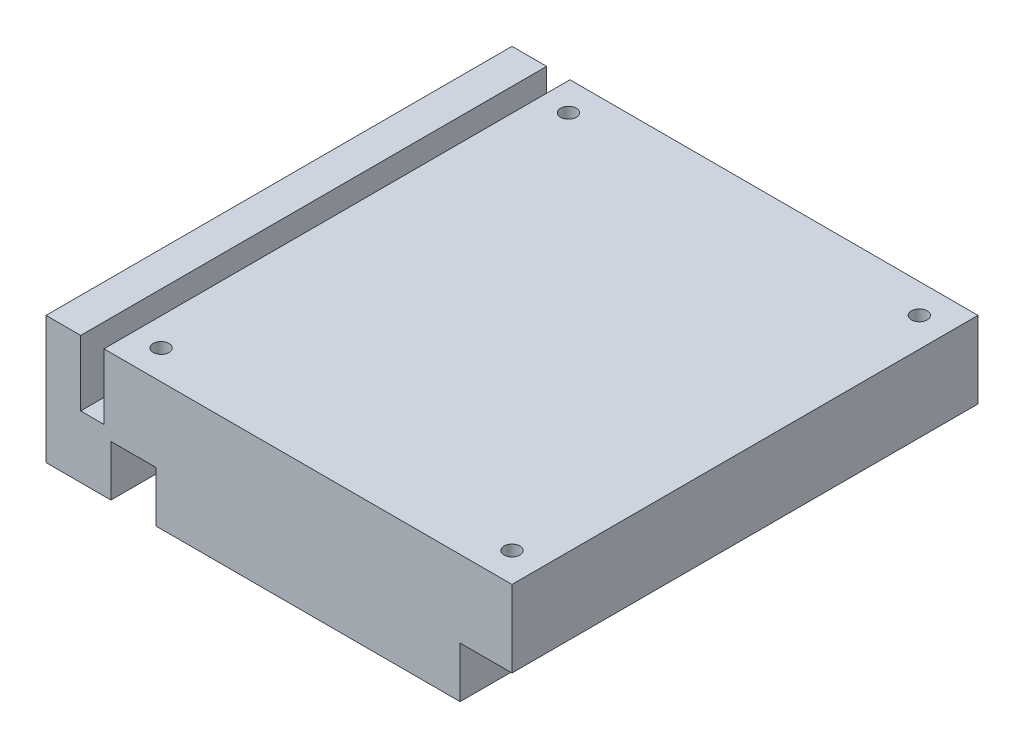
ISO-10303-21;
HEADER;
FILE_DESCRIPTION(('STEP AP214'),'2;1');
FILE_NAME('part.step','',(''),(''),'','','');
FILE_SCHEMA(('AUTOMOTIVE_DESIGN { 1 0 10303 214 1 1 1 1 }'));
ENDSEC;
DATA;
#1=APPLICATION_CONTEXT('core data for automotive mechanical design processes');
#2=APPLICATION_PROTOCOL_DEFINITION('international standard','automotive_design',2000,#1);
#3=PRODUCT_CONTEXT('',#1,'mechanical');
#4=PRODUCT('Part','Part','',(#3));
#5=PRODUCT_RELATED_PRODUCT_CATEGORY('part','',(#4));
#6=PRODUCT_DEFINITION_FORMATION('','',#4);
#7=PRODUCT_DEFINITION_CONTEXT('part definition',#1,'design');
#8=PRODUCT_DEFINITION('design','',#6,#7);
#9=PRODUCT_DEFINITION_SHAPE('','',#8);
#10=(LENGTH_UNIT() NAMED_UNIT(*) SI_UNIT(.MILLI.,.METRE.));
#11=(NAMED_UNIT(*) PLANE_ANGLE_UNIT() SI_UNIT($,.RADIAN.));
#12=(NAMED_UNIT(*) SI_UNIT($,.STERADIAN.) SOLID_ANGLE_UNIT());
#13=UNCERTAINTY_MEASURE_WITH_UNIT(LENGTH_MEASURE(1.E-05),#10,'distance_accuracy_value','');
#14=(GEOMETRIC_REPRESENTATION_CONTEXT(3) GLOBAL_UNCERTAINTY_ASSIGNED_CONTEXT((#13)) GLOBAL_UNIT_ASSIGNED_CONTEXT((#10,
#11,#12)) REPRESENTATION_CONTEXT('',''));
#15=CARTESIAN_POINT('',(0.,0.,0.));
#16=DIRECTION('',(0.,0.,1.));
#17=DIRECTION('',(1.,0.,0.));
#18=AXIS2_PLACEMENT_3D('',#15,#16,#17);
#19=CARTESIAN_POINT('',(0.,0.,0.));
#20=DIRECTION('',(0.,-1.,0.));
#21=DIRECTION('',(0.,0.,-1.));
#22=AXIS2_PLACEMENT_3D('',#19,#20,#21);
#23=PLANE('',#22);
#24=CARTESIAN_POINT('',(98.298,0.,-98.298));
#25=DIRECTION('',(0.,1.,0.));
#26=DIRECTION('',(0.,0.,1.));
#27=AXIS2_PLACEMENT_3D('',#24,#25,#26);
#28=CIRCLE('',#27,1.778);
#29=CARTESIAN_POINT('',(98.298,0.,-96.52));
#30=VERTEX_POINT('',#29);
#31=EDGE_CURVE('E254',#30,#30,#28,.T.);
#32=ORIENTED_EDGE('',*,*,#31,.T.);
#33=EDGE_LOOP('',(#32));
#34=FACE_BOUND('',#33,.T.);
#35=CARTESIAN_POINT('',(19.304,0.,-6.604));
#36=DIRECTION('',(0.,1.,0.));
#37=DIRECTION('',(0.,0.,1.));
#38=AXIS2_PLACEMENT_3D('',#35,#36,#37);
#39=CIRCLE('',#38,1.778);
#40=CARTESIAN_POINT('',(19.304,0.,-4.826));
#41=VERTEX_POINT('',#40);
#42=EDGE_CURVE('E261',#41,#41,#39,.T.);
#43=ORIENTED_EDGE('',*,*,#42,.T.);
#44=EDGE_LOOP('',(#43));
#45=FACE_BOUND('',#44,.T.);
#46=CARTESIAN_POINT('',(19.304,0.,-98.298));
#47=DIRECTION('',(0.,1.,0.));
#48=DIRECTION('',(0.,0.,1.));
#49=AXIS2_PLACEMENT_3D('',#46,#47,#48);
#50=CIRCLE('',#49,1.778);
#51=CARTESIAN_POINT('',(19.304,0.,-96.52));
#52=VERTEX_POINT('',#51);
#53=EDGE_CURVE('E248',#52,#52,#50,.T.);
#54=ORIENTED_EDGE('',*,*,#53,.T.);
#55=EDGE_LOOP('',(#54));
#56=FACE_BOUND('',#55,.T.);
#57=CARTESIAN_POINT('',(98.298,0.,-6.604));
#58=DIRECTION('',(0.,1.,0.));
#59=DIRECTION('',(0.,0.,1.));
#60=AXIS2_PLACEMENT_3D('',#57,#58,#59);
#61=CIRCLE('',#60,1.77800000000001);
#62=CARTESIAN_POINT('',(98.298,0.,-4.82599999999999));
#63=VERTEX_POINT('',#62);
#64=EDGE_CURVE('E266',#63,#63,#61,.T.);
#65=ORIENTED_EDGE('',*,*,#64,.T.);
#66=EDGE_LOOP('',(#65));
#67=FACE_BOUND('',#66,.T.);
#68=DIRECTION('',(0.,0.,1.));
#69=VECTOR('',#68,1.);
#70=CARTESIAN_POINT('',(14.6169324071934,0.,0.));
#71=LINE('',#70,#69);
#72=CARTESIAN_POINT('',(14.6169324071934,0.,-13.5988038651931));
#73=VERTEX_POINT('',#72);
#74=CARTESIAN_POINT('',(14.6169324071934,0.,0.));
#75=VERTEX_POINT('',#74);
#76=EDGE_CURVE('E182',#73,#75,#71,.T.);
#77=ORIENTED_EDGE('',*,*,#76,.F.);
#78=DIRECTION('',(1.,0.,0.));
#79=VECTOR('',#78,1.);
#80=CARTESIAN_POINT('',(0.,0.,-13.5988038651931));
#81=LINE('',#80,#79);
#82=CARTESIAN_POINT('',(0.,0.,-13.5988038651931));
#83=VERTEX_POINT('',#82);
#84=EDGE_CURVE('E523',#83,#73,#81,.T.);
#85=ORIENTED_EDGE('',*,*,#84,.F.);
#86=DIRECTION('',(0.,0.,1.));
#87=VECTOR('',#86,1.);
#88=CARTESIAN_POINT('',(0.,0.,0.));
#89=LINE('',#88,#87);
#90=CARTESIAN_POINT('',(0.,0.,-104.902));
#91=VERTEX_POINT('',#90);
#92=EDGE_CURVE('E187',#91,#83,#89,.T.);
#93=ORIENTED_EDGE('',*,*,#92,.F.);
#94=DIRECTION('',(-1.,0.,0.));
#95=VECTOR('',#94,1.);
#96=CARTESIAN_POINT('',(0.,0.,-104.902));
#97=LINE('',#96,#95);
#98=CARTESIAN_POINT('',(24.7616566583702,0.,-104.902));
#99=VERTEX_POINT('',#98);
#100=EDGE_CURVE('E321',#99,#91,#97,.T.);
#101=ORIENTED_EDGE('',*,*,#100,.F.);
#102=DIRECTION('',(0.,0.,-1.));
#103=VECTOR('',#102,1.);
#104=CARTESIAN_POINT('',(24.7616566583702,0.,-104.902));
#105=LINE('',#104,#103);
#106=CARTESIAN_POINT('',(24.7616566583702,0.,-90.0827782132865));
#107=VERTEX_POINT('',#106);
#108=EDGE_CURVE('E217',#107,#99,#105,.T.);
#109=ORIENTED_EDGE('',*,*,#108,.F.);
#110=DIRECTION('',(-1.,0.,0.));
#111=VECTOR('',#110,1.);
#112=CARTESIAN_POINT('',(24.7616566583702,0.,-90.0827782132865));
#113=LINE('',#112,#111);
#114=CARTESIAN_POINT('',(93.2207552415321,0.,-90.0827782132865));
#115=VERTEX_POINT('',#114);
#116=EDGE_CURVE('E222',#115,#107,#113,.T.);
#117=ORIENTED_EDGE('',*,*,#116,.F.);
#118=DIRECTION('',(0.,0.,1.));
#119=VECTOR('',#118,1.);
#120=CARTESIAN_POINT('',(93.2207552415321,0.,-104.902));
#121=LINE('',#120,#119);
#122=CARTESIAN_POINT('',(93.2207552415321,0.,-104.902));
#123=VERTEX_POINT('',#122);
#124=EDGE_CURVE('E231',#123,#115,#121,.T.);
#125=ORIENTED_EDGE('',*,*,#124,.F.);
#126=CARTESIAN_POINT('',(104.902,0.,-104.902));
#127=VERTEX_POINT('',#126);
#128=EDGE_CURVE('E312',#127,#123,#97,.T.);
#129=ORIENTED_EDGE('',*,*,#128,.F.);
#130=DIRECTION('',(0.,0.,-1.));
#131=VECTOR('',#130,1.);
#132=CARTESIAN_POINT('',(104.902,0.,0.));
#133=LINE('',#132,#131);
#134=CARTESIAN_POINT('',(104.902,0.,0.));
#135=VERTEX_POINT('',#134);
#136=EDGE_CURVE('E319',#135,#127,#133,.T.);
#137=ORIENTED_EDGE('',*,*,#136,.F.);
#138=DIRECTION('',(1.,0.,0.));
#139=VECTOR('',#138,1.);
#140=CARTESIAN_POINT('',(0.,0.,0.));
#141=LINE('',#140,#139);
#142=CARTESIAN_POINT('',(93.2207552415321,0.,0.));
#143=VERTEX_POINT('',#142);
#144=EDGE_CURVE('E316',#143,#135,#141,.T.);
#145=ORIENTED_EDGE('',*,*,#144,.F.);
#146=DIRECTION('',(0.,0.,1.));
#147=VECTOR('',#146,1.);
#148=CARTESIAN_POINT('',(93.2207552415321,0.,0.));
#149=LINE('',#148,#147);
#150=CARTESIAN_POINT('',(93.2207552415321,0.,-13.5988038651931));
#151=VERTEX_POINT('',#150);
#152=EDGE_CURVE('E200',#151,#143,#149,.T.);
#153=ORIENTED_EDGE('',*,*,#152,.F.);
#154=DIRECTION('',(1.,0.,0.));
#155=VECTOR('',#154,1.);
#156=CARTESIAN_POINT('',(24.7616566583702,0.,-13.5988038651931));
#157=LINE('',#156,#155);
#158=CARTESIAN_POINT('',(24.7616566583702,0.,-13.5988038651931));
#159=VERTEX_POINT('',#158);
#160=EDGE_CURVE('E191',#159,#151,#157,.T.);
#161=ORIENTED_EDGE('',*,*,#160,.F.);
#162=DIRECTION('',(0.,0.,-1.));
#163=VECTOR('',#162,1.);
#164=CARTESIAN_POINT('',(24.7616566583702,0.,0.));
#165=LINE('',#164,#163);
#166=CARTESIAN_POINT('',(24.7616566583702,0.,0.));
#167=VERTEX_POINT('',#166);
#168=EDGE_CURVE('E188',#167,#159,#165,.T.);
#169=ORIENTED_EDGE('',*,*,#168,.F.);
#170=EDGE_CURVE('E317',#75,#167,#141,.T.);
#171=ORIENTED_EDGE('',*,*,#170,.F.);
#172=EDGE_LOOP('',(#77,#85,#93,#101,#109,#117,#125,#129,#137,#145,#153,#161,#169,#171));
#173=FACE_BOUND('',#172,.T.);
#174=ADVANCED_FACE('F34',(#34,#45,#56,#67,#173),#23,.T.);
#175=CARTESIAN_POINT('',(0.,2.54,0.));
#176=DIRECTION('',(0.,-1.,0.));
#177=DIRECTION('',(0.,0.,-1.));
#178=AXIS2_PLACEMENT_3D('',#175,#176,#177);
#179=PLANE('',#178);
#180=DIRECTION('',(0.,0.,-1.));
#181=VECTOR('',#180,1.);
#182=CARTESIAN_POINT('',(7.80674517869784,2.54,-104.902));
#183=LINE('',#182,#181);
#184=CARTESIAN_POINT('',(7.80674517869784,2.54,0.));
#185=VERTEX_POINT('',#184);
#186=CARTESIAN_POINT('',(7.80674517869784,2.54,-104.902));
#187=VERTEX_POINT('',#186);
#188=EDGE_CURVE('E269',#185,#187,#183,.T.);
#189=ORIENTED_EDGE('',*,*,#188,.F.);
#190=DIRECTION('',(1.,0.,0.));
#191=VECTOR('',#190,1.);
#192=CARTESIAN_POINT('',(0.,2.54,0.));
#193=LINE('',#192,#191);
#194=CARTESIAN_POINT('',(13.0400763707712,2.54,0.));
#195=VERTEX_POINT('',#194);
#196=EDGE_CURVE('E309',#185,#195,#193,.T.);
#197=ORIENTED_EDGE('',*,*,#196,.T.);
#198=DIRECTION('',(0.,0.,1.));
#199=VECTOR('',#198,1.);
#200=CARTESIAN_POINT('',(13.0400763707712,2.54,0.));
#201=LINE('',#200,#199);
#202=CARTESIAN_POINT('',(13.0400763707712,2.54,-104.902));
#203=VERTEX_POINT('',#202);
#204=EDGE_CURVE('E290',#203,#195,#201,.T.);
#205=ORIENTED_EDGE('',*,*,#204,.F.);
#206=DIRECTION('',(-1.,0.,0.));
#207=VECTOR('',#206,1.);
#208=CARTESIAN_POINT('',(0.,2.54,-104.902));
#209=LINE('',#208,#207);
#210=EDGE_CURVE('E311',#203,#187,#209,.T.);
#211=ORIENTED_EDGE('',*,*,#210,.T.);
#212=EDGE_LOOP('',(#189,#197,#205,#211));
#213=FACE_BOUND('',#212,.T.);
#214=ADVANCED_FACE('F366',(#213),#179,.F.);
#215=CARTESIAN_POINT('',(0.,2.54,0.));
#216=DIRECTION('',(1.,0.,0.));
#217=DIRECTION('',(0.,0.,-1.));
#218=AXIS2_PLACEMENT_3D('',#215,#216,#217);
#219=PLANE('',#218);
#220=ORIENTED_EDGE('',*,*,#92,.T.);
#221=DIRECTION('',(0.,1.,0.));
#222=VECTOR('',#221,1.);
#223=CARTESIAN_POINT('',(0.,-11.43,-13.5988038651931));
#224=LINE('',#223,#222);
#225=CARTESIAN_POINT('',(0.,-11.43,-13.5988038651931));
#226=VERTEX_POINT('',#225);
#227=EDGE_CURVE('E168',#226,#83,#224,.T.);
#228=ORIENTED_EDGE('',*,*,#227,.F.);
#229=DIRECTION('',(0.,0.,-1.));
#230=VECTOR('',#229,1.);
#231=CARTESIAN_POINT('',(0.,-11.43,0.));
#232=LINE('',#231,#230);
#233=CARTESIAN_POINT('',(0.,-11.43,0.));
#234=VERTEX_POINT('',#233);
#235=EDGE_CURVE('E175',#234,#226,#232,.T.);
#236=ORIENTED_EDGE('',*,*,#235,.F.);
#237=DIRECTION('',(0.,-1.,0.));
#238=VECTOR('',#237,1.);
#239=CARTESIAN_POINT('',(0.,2.54,0.));
#240=LINE('',#239,#238);
#241=CARTESIAN_POINT('',(0.,17.272,0.));
#242=VERTEX_POINT('',#241);
#243=EDGE_CURVE('E11',#242,#234,#240,.T.);
#244=ORIENTED_EDGE('',*,*,#243,.F.);
#245=DIRECTION('',(0.,0.,1.));
#246=VECTOR('',#245,1.);
#247=CARTESIAN_POINT('',(0.,17.272,-104.902));
#248=LINE('',#247,#246);
#249=CARTESIAN_POINT('',(0.,17.272,-104.902));
#250=VERTEX_POINT('',#249);
#251=EDGE_CURVE('E272',#250,#242,#248,.T.);
#252=ORIENTED_EDGE('',*,*,#251,.F.);
#253=DIRECTION('',(0.,-1.,0.));
#254=VECTOR('',#253,1.);
#255=CARTESIAN_POINT('',(0.,2.54,-104.902));
#256=LINE('',#255,#254);
#257=EDGE_CURVE('E314',#250,#91,#256,.T.);
#258=ORIENTED_EDGE('',*,*,#257,.T.);
#259=EDGE_LOOP('',(#220,#228,#236,#244,#252,#258));
#260=FACE_BOUND('',#259,.T.);
#261=ADVANCED_FACE('F36',(#260),#219,.F.);
#262=CARTESIAN_POINT('',(0.,2.54,0.));
#263=DIRECTION('',(0.,0.,-1.));
#264=DIRECTION('',(-1.,0.,0.));
#265=AXIS2_PLACEMENT_3D('',#262,#263,#264);
#266=PLANE('',#265);
#267=ORIENTED_EDGE('',*,*,#243,.T.);
#268=DIRECTION('',(-1.,0.,0.));
#269=VECTOR('',#268,1.);
#270=CARTESIAN_POINT('',(0.,-11.43,0.));
#271=LINE('',#270,#269);
#272=CARTESIAN_POINT('',(14.6169324071934,-11.43,0.));
#273=VERTEX_POINT('',#272);
#274=EDGE_CURVE('E180',#273,#234,#271,.T.);
#275=ORIENTED_EDGE('',*,*,#274,.F.);
#276=DIRECTION('',(0.,1.,0.));
#277=VECTOR('',#276,1.);
#278=CARTESIAN_POINT('',(14.6169324071934,-11.43,0.));
#279=LINE('',#278,#277);
#280=EDGE_CURVE('E49',#273,#75,#279,.T.);
#281=ORIENTED_EDGE('',*,*,#280,.T.);
#282=ORIENTED_EDGE('',*,*,#170,.T.);
#283=DIRECTION('',(0.,1.,0.));
#284=VECTOR('',#283,1.);
#285=CARTESIAN_POINT('',(24.7616566583702,-11.43,0.));
#286=LINE('',#285,#284);
#287=CARTESIAN_POINT('',(24.7616566583702,-11.43,0.));
#288=VERTEX_POINT('',#287);
#289=EDGE_CURVE('E205',#288,#167,#286,.T.);
#290=ORIENTED_EDGE('',*,*,#289,.F.);
#291=DIRECTION('',(-1.,0.,0.));
#292=VECTOR('',#291,1.);
#293=CARTESIAN_POINT('',(24.7616566583702,-11.43,0.));
#294=LINE('',#293,#292);
#295=CARTESIAN_POINT('',(93.2207552415321,-11.43,0.));
#296=VERTEX_POINT('',#295);
#297=EDGE_CURVE('E204',#296,#288,#294,.T.);
#298=ORIENTED_EDGE('',*,*,#297,.F.);
#299=DIRECTION('',(0.,1.,0.));
#300=VECTOR('',#299,1.);
#301=CARTESIAN_POINT('',(93.2207552415321,-11.43,0.));
#302=LINE('',#301,#300);
#303=EDGE_CURVE('E56',#296,#143,#302,.T.);
#304=ORIENTED_EDGE('',*,*,#303,.T.);
#305=ORIENTED_EDGE('',*,*,#144,.T.);
#306=DIRECTION('',(0.,-1.,0.));
#307=VECTOR('',#306,1.);
#308=CARTESIAN_POINT('',(104.902,2.54,0.));
#309=LINE('',#308,#307);
#310=CARTESIAN_POINT('',(104.902,17.272,0.));
#311=VERTEX_POINT('',#310);
#312=EDGE_CURVE('E42',#311,#135,#309,.T.);
#313=ORIENTED_EDGE('',*,*,#312,.F.);
#314=DIRECTION('',(1.,0.,0.));
#315=VECTOR('',#314,1.);
#316=CARTESIAN_POINT('',(104.902,17.272,0.));
#317=LINE('',#316,#315);
#318=CARTESIAN_POINT('',(13.0400763707712,17.272,0.));
#319=VERTEX_POINT('',#318);
#320=EDGE_CURVE('E298',#319,#311,#317,.T.);
#321=ORIENTED_EDGE('',*,*,#320,.F.);
#322=DIRECTION('',(0.,-1.,0.));
#323=VECTOR('',#322,1.);
#324=CARTESIAN_POINT('',(13.0400763707712,17.272,0.));
#325=LINE('',#324,#323);
#326=EDGE_CURVE('E301',#319,#195,#325,.T.);
#327=ORIENTED_EDGE('',*,*,#326,.T.);
#328=ORIENTED_EDGE('',*,*,#196,.F.);
#329=DIRECTION('',(0.,-1.,0.));
#330=VECTOR('',#329,1.);
#331=CARTESIAN_POINT('',(7.80674517869784,17.272,0.));
#332=LINE('',#331,#330);
#333=CARTESIAN_POINT('',(7.80674517869784,17.272,0.));
#334=VERTEX_POINT('',#333);
#335=EDGE_CURVE('E287',#334,#185,#332,.T.);
#336=ORIENTED_EDGE('',*,*,#335,.F.);
#337=DIRECTION('',(1.,0.,0.));
#338=VECTOR('',#337,1.);
#339=CARTESIAN_POINT('',(0.,17.272,0.));
#340=LINE('',#339,#338);
#341=EDGE_CURVE('E275',#242,#334,#340,.T.);
#342=ORIENTED_EDGE('',*,*,#341,.F.);
#343=EDGE_LOOP('',(#267,#275,#281,#282,#290,#298,#304,#305,#313,#321,#327,#328,#336,#342));
#344=FACE_BOUND('',#343,.T.);
#345=ADVANCED_FACE('F381',(#344),#266,.F.);
#346=CARTESIAN_POINT('',(104.902,2.54,0.));
#347=DIRECTION('',(-1.,0.,0.));
#348=DIRECTION('',(0.,0.,1.));
#349=AXIS2_PLACEMENT_3D('',#346,#347,#348);
#350=PLANE('',#349);
#351=ORIENTED_EDGE('',*,*,#136,.T.);
#352=DIRECTION('',(0.,-1.,0.));
#353=VECTOR('',#352,1.);
#354=CARTESIAN_POINT('',(104.902,2.54,-104.902));
#355=LINE('',#354,#353);
#356=CARTESIAN_POINT('',(104.902,17.272,-104.902));
#357=VERTEX_POINT('',#356);
#358=EDGE_CURVE('E325',#357,#127,#355,.T.);
#359=ORIENTED_EDGE('',*,*,#358,.F.);
#360=DIRECTION('',(0.,0.,-1.));
#361=VECTOR('',#360,1.);
#362=CARTESIAN_POINT('',(104.902,17.272,0.));
#363=LINE('',#362,#361);
#364=EDGE_CURVE('E291',#311,#357,#363,.T.);
#365=ORIENTED_EDGE('',*,*,#364,.F.);
#366=ORIENTED_EDGE('',*,*,#312,.T.);
#367=EDGE_LOOP('',(#351,#359,#365,#366));
#368=FACE_BOUND('',#367,.T.);
#369=ADVANCED_FACE('F331',(#368),#350,.F.);
#370=CARTESIAN_POINT('',(0.,2.54,-104.902));
#371=DIRECTION('',(0.,0.,1.));
#372=DIRECTION('',(1.,0.,0.));
#373=AXIS2_PLACEMENT_3D('',#370,#371,#372);
#374=PLANE('',#373);
#375=ORIENTED_EDGE('',*,*,#128,.T.);
#376=DIRECTION('',(0.,1.,0.));
#377=VECTOR('',#376,1.);
#378=CARTESIAN_POINT('',(93.2207552415321,-11.43,-104.902));
#379=LINE('',#378,#377);
#380=CARTESIAN_POINT('',(93.2207552415321,-11.43,-104.902));
#381=VERTEX_POINT('',#380);
#382=EDGE_CURVE('E241',#381,#123,#379,.T.);
#383=ORIENTED_EDGE('',*,*,#382,.F.);
#384=DIRECTION('',(1.,0.,0.));
#385=VECTOR('',#384,1.);
#386=CARTESIAN_POINT('',(24.7616566583702,-11.43,-104.902));
#387=LINE('',#386,#385);
#388=CARTESIAN_POINT('',(24.7616566583702,-11.43,-104.902));
#389=VERTEX_POINT('',#388);
#390=EDGE_CURVE('E221',#389,#381,#387,.T.);
#391=ORIENTED_EDGE('',*,*,#390,.F.);
#392=DIRECTION('',(0.,1.,0.));
#393=VECTOR('',#392,1.);
#394=CARTESIAN_POINT('',(24.7616566583702,-11.43,-104.902));
#395=LINE('',#394,#393);
#396=EDGE_CURVE('E244',#389,#99,#395,.T.);
#397=ORIENTED_EDGE('',*,*,#396,.T.);
#398=ORIENTED_EDGE('',*,*,#100,.T.);
#399=ORIENTED_EDGE('',*,*,#257,.F.);
#400=DIRECTION('',(-1.,0.,0.));
#401=VECTOR('',#400,1.);
#402=CARTESIAN_POINT('',(0.,17.272,-104.902));
#403=LINE('',#402,#401);
#404=CARTESIAN_POINT('',(7.80674517869784,17.272,-104.902));
#405=VERTEX_POINT('',#404);
#406=EDGE_CURVE('E279',#405,#250,#403,.T.);
#407=ORIENTED_EDGE('',*,*,#406,.F.);
#408=DIRECTION('',(0.,-1.,0.));
#409=VECTOR('',#408,1.);
#410=CARTESIAN_POINT('',(7.80674517869784,17.272,-104.902));
#411=LINE('',#410,#409);
#412=EDGE_CURVE('E282',#405,#187,#411,.T.);
#413=ORIENTED_EDGE('',*,*,#412,.T.);
#414=ORIENTED_EDGE('',*,*,#210,.F.);
#415=DIRECTION('',(0.,-1.,0.));
#416=VECTOR('',#415,1.);
#417=CARTESIAN_POINT('',(13.0400763707712,17.272,-104.902));
#418=LINE('',#417,#416);
#419=CARTESIAN_POINT('',(13.0400763707712,17.272,-104.902));
#420=VERTEX_POINT('',#419);
#421=EDGE_CURVE('E306',#420,#203,#418,.T.);
#422=ORIENTED_EDGE('',*,*,#421,.F.);
#423=DIRECTION('',(-1.,0.,0.));
#424=VECTOR('',#423,1.);
#425=CARTESIAN_POINT('',(104.902,17.272,-104.902));
#426=LINE('',#425,#424);
#427=EDGE_CURVE('E294',#357,#420,#426,.T.);
#428=ORIENTED_EDGE('',*,*,#427,.F.);
#429=ORIENTED_EDGE('',*,*,#358,.T.);
#430=EDGE_LOOP('',(#375,#383,#391,#397,#398,#399,#407,#413,#414,#422,#428,#429));
#431=FACE_BOUND('',#430,.T.);
#432=ADVANCED_FACE('F340',(#431),#374,.F.);
#433=CARTESIAN_POINT('',(13.0400763707712,17.272,0.));
#434=DIRECTION('',(1.,0.,0.));
#435=DIRECTION('',(0.,0.,-1.));
#436=AXIS2_PLACEMENT_3D('',#433,#434,#435);
#437=PLANE('',#436);
#438=ORIENTED_EDGE('',*,*,#204,.T.);
#439=ORIENTED_EDGE('',*,*,#326,.F.);
#440=DIRECTION('',(0.,0.,1.));
#441=VECTOR('',#440,1.);
#442=CARTESIAN_POINT('',(13.0400763707712,17.272,0.));
#443=LINE('',#442,#441);
#444=EDGE_CURVE('E296',#420,#319,#443,.T.);
#445=ORIENTED_EDGE('',*,*,#444,.F.);
#446=ORIENTED_EDGE('',*,*,#421,.T.);
#447=EDGE_LOOP('',(#438,#439,#445,#446));
#448=FACE_BOUND('',#447,.T.);
#449=ADVANCED_FACE('F379',(#448),#437,.F.);
#450=CARTESIAN_POINT('',(0.,17.272,0.));
#451=DIRECTION('',(0.,1.,0.));
#452=DIRECTION('',(0.,0.,1.));
#453=AXIS2_PLACEMENT_3D('',#450,#451,#452);
#454=PLANE('',#453);
#455=CARTESIAN_POINT('',(98.298,17.272,-98.298));
#456=DIRECTION('',(0.,1.,0.));
#457=DIRECTION('',(0.,0.,1.));
#458=AXIS2_PLACEMENT_3D('',#455,#456,#457);
#459=CIRCLE('',#458,1.778);
#460=CARTESIAN_POINT('',(98.298,17.272,-96.52));
#461=VERTEX_POINT('',#460);
#462=EDGE_CURVE('E258',#461,#461,#459,.T.);
#463=ORIENTED_EDGE('',*,*,#462,.F.);
#464=EDGE_LOOP('',(#463));
#465=FACE_BOUND('',#464,.T.);
#466=CARTESIAN_POINT('',(19.304,17.272,-6.604));
#467=DIRECTION('',(0.,1.,0.));
#468=DIRECTION('',(0.,0.,1.));
#469=AXIS2_PLACEMENT_3D('',#466,#467,#468);
#470=CIRCLE('',#469,1.778);
#471=CARTESIAN_POINT('',(19.304,17.272,-4.826));
#472=VERTEX_POINT('',#471);
#473=EDGE_CURVE('E251',#472,#472,#470,.T.);
#474=ORIENTED_EDGE('',*,*,#473,.F.);
#475=EDGE_LOOP('',(#474));
#476=FACE_BOUND('',#475,.T.);
#477=CARTESIAN_POINT('',(19.304,17.272,-98.298));
#478=DIRECTION('',(0.,1.,0.));
#479=DIRECTION('',(0.,0.,1.));
#480=AXIS2_PLACEMENT_3D('',#477,#478,#479);
#481=CIRCLE('',#480,1.778);
#482=CARTESIAN_POINT('',(19.304,17.272,-96.52));
#483=VERTEX_POINT('',#482);
#484=EDGE_CURVE('E247',#483,#483,#481,.T.);
#485=ORIENTED_EDGE('',*,*,#484,.F.);
#486=EDGE_LOOP('',(#485));
#487=FACE_BOUND('',#486,.T.);
#488=CARTESIAN_POINT('',(98.298,17.272,-6.604));
#489=DIRECTION('',(0.,1.,0.));
#490=DIRECTION('',(0.,0.,1.));
#491=AXIS2_PLACEMENT_3D('',#488,#489,#490);
#492=CIRCLE('',#491,1.77800000000001);
#493=CARTESIAN_POINT('',(98.298,17.272,-4.82599999999999));
#494=VERTEX_POINT('',#493);
#495=EDGE_CURVE('E257',#494,#494,#492,.T.);
#496=ORIENTED_EDGE('',*,*,#495,.F.);
#497=EDGE_LOOP('',(#496));
#498=FACE_BOUND('',#497,.T.);
#499=ORIENTED_EDGE('',*,*,#364,.T.);
#500=ORIENTED_EDGE('',*,*,#427,.T.);
#501=ORIENTED_EDGE('',*,*,#444,.T.);
#502=ORIENTED_EDGE('',*,*,#320,.T.);
#503=EDGE_LOOP('',(#499,#500,#501,#502));
#504=FACE_BOUND('',#503,.T.);
#505=ADVANCED_FACE('F403',(#465,#476,#487,#498,#504),#454,.T.);
#506=CARTESIAN_POINT('',(7.80674517869784,17.272,-104.902));
#507=DIRECTION('',(-1.,0.,0.));
#508=DIRECTION('',(0.,0.,1.));
#509=AXIS2_PLACEMENT_3D('',#506,#507,#508);
#510=PLANE('',#509);
#511=ORIENTED_EDGE('',*,*,#188,.T.);
#512=ORIENTED_EDGE('',*,*,#412,.F.);
#513=DIRECTION('',(0.,0.,-1.));
#514=VECTOR('',#513,1.);
#515=CARTESIAN_POINT('',(7.80674517869784,17.272,-104.902));
#516=LINE('',#515,#514);
#517=EDGE_CURVE('E277',#334,#405,#516,.T.);
#518=ORIENTED_EDGE('',*,*,#517,.F.);
#519=ORIENTED_EDGE('',*,*,#335,.T.);
#520=EDGE_LOOP('',(#511,#512,#518,#519));
#521=FACE_BOUND('',#520,.T.);
#522=ADVANCED_FACE('F397',(#521),#510,.F.);
#523=CARTESIAN_POINT('',(0.,17.272,0.));
#524=DIRECTION('',(0.,1.,0.));
#525=DIRECTION('',(0.,0.,1.));
#526=AXIS2_PLACEMENT_3D('',#523,#524,#525);
#527=PLANE('',#526);
#528=ORIENTED_EDGE('',*,*,#251,.T.);
#529=ORIENTED_EDGE('',*,*,#341,.T.);
#530=ORIENTED_EDGE('',*,*,#517,.T.);
#531=ORIENTED_EDGE('',*,*,#406,.T.);
#532=EDGE_LOOP('',(#528,#529,#530,#531));
#533=FACE_BOUND('',#532,.T.);
#534=ADVANCED_FACE('F390',(#533),#527,.T.);
#535=CARTESIAN_POINT('',(98.298,0.,-6.604));
#536=DIRECTION('',(0.,1.,0.));
#537=DIRECTION('',(0.,0.,1.));
#538=AXIS2_PLACEMENT_3D('',#535,#536,#537);
#539=CYLINDRICAL_SURFACE('',#538,1.77800000000001);
#540=ORIENTED_EDGE('',*,*,#64,.F.);
#541=EDGE_LOOP('',(#540));
#542=FACE_BOUND('',#541,.T.);
#543=ORIENTED_EDGE('',*,*,#495,.T.);
#544=EDGE_LOOP('',(#543));
#545=FACE_BOUND('',#544,.T.);
#546=ADVANCED_FACE('F417',(#542,#545),#539,.F.);
#547=CARTESIAN_POINT('',(19.304,0.,-98.298));
#548=DIRECTION('',(0.,1.,0.));
#549=DIRECTION('',(0.,0.,1.));
#550=AXIS2_PLACEMENT_3D('',#547,#548,#549);
#551=CYLINDRICAL_SURFACE('',#550,1.778);
#552=ORIENTED_EDGE('',*,*,#53,.F.);
#553=EDGE_LOOP('',(#552));
#554=FACE_BOUND('',#553,.T.);
#555=ORIENTED_EDGE('',*,*,#484,.T.);
#556=EDGE_LOOP('',(#555));
#557=FACE_BOUND('',#556,.T.);
#558=ADVANCED_FACE('F420',(#554,#557),#551,.F.);
#559=CARTESIAN_POINT('',(19.304,0.,-6.604));
#560=DIRECTION('',(0.,1.,0.));
#561=DIRECTION('',(0.,0.,1.));
#562=AXIS2_PLACEMENT_3D('',#559,#560,#561);
#563=CYLINDRICAL_SURFACE('',#562,1.778);
#564=ORIENTED_EDGE('',*,*,#42,.F.);
#565=EDGE_LOOP('',(#564));
#566=FACE_BOUND('',#565,.T.);
#567=ORIENTED_EDGE('',*,*,#473,.T.);
#568=EDGE_LOOP('',(#567));
#569=FACE_BOUND('',#568,.T.);
#570=ADVANCED_FACE('F422',(#566,#569),#563,.F.);
#571=CARTESIAN_POINT('',(98.298,0.,-98.298));
#572=DIRECTION('',(0.,1.,0.));
#573=DIRECTION('',(0.,0.,1.));
#574=AXIS2_PLACEMENT_3D('',#571,#572,#573);
#575=CYLINDRICAL_SURFACE('',#574,1.778);
#576=ORIENTED_EDGE('',*,*,#31,.F.);
#577=EDGE_LOOP('',(#576));
#578=FACE_BOUND('',#577,.T.);
#579=ORIENTED_EDGE('',*,*,#462,.T.);
#580=EDGE_LOOP('',(#579));
#581=FACE_BOUND('',#580,.T.);
#582=ADVANCED_FACE('F425',(#578,#581),#575,.F.);
#583=CARTESIAN_POINT('',(24.7616566583702,-11.43,-104.902));
#584=DIRECTION('',(1.,0.,0.));
#585=DIRECTION('',(0.,0.,-1.));
#586=AXIS2_PLACEMENT_3D('',#583,#584,#585);
#587=PLANE('',#586);
#588=ORIENTED_EDGE('',*,*,#108,.T.);
#589=ORIENTED_EDGE('',*,*,#396,.F.);
#590=DIRECTION('',(0.,0.,-1.));
#591=VECTOR('',#590,1.);
#592=CARTESIAN_POINT('',(24.7616566583702,-11.43,-104.902));
#593=LINE('',#592,#591);
#594=CARTESIAN_POINT('',(24.7616566583702,-11.43,-90.0827782132865));
#595=VERTEX_POINT('',#594);
#596=EDGE_CURVE('E218',#595,#389,#593,.T.);
#597=ORIENTED_EDGE('',*,*,#596,.F.);
#598=DIRECTION('',(0.,1.,0.));
#599=VECTOR('',#598,1.);
#600=CARTESIAN_POINT('',(24.7616566583702,-11.43,-90.0827782132865));
#601=LINE('',#600,#599);
#602=EDGE_CURVE('E228',#595,#107,#601,.T.);
#603=ORIENTED_EDGE('',*,*,#602,.T.);
#604=EDGE_LOOP('',(#588,#589,#597,#603));
#605=FACE_BOUND('',#604,.T.);
#606=ADVANCED_FACE('F353',(#605),#587,.F.);
#607=CARTESIAN_POINT('',(93.2207552415321,-11.43,-104.902));
#608=DIRECTION('',(-1.,0.,0.));
#609=DIRECTION('',(0.,0.,1.));
#610=AXIS2_PLACEMENT_3D('',#607,#608,#609);
#611=PLANE('',#610);
#612=ORIENTED_EDGE('',*,*,#124,.T.);
#613=DIRECTION('',(0.,1.,0.));
#614=VECTOR('',#613,1.);
#615=CARTESIAN_POINT('',(93.2207552415321,-11.43,-90.0827782132865));
#616=LINE('',#615,#614);
#617=CARTESIAN_POINT('',(93.2207552415321,-11.43,-90.0827782132865));
#618=VERTEX_POINT('',#617);
#619=EDGE_CURVE('E238',#618,#115,#616,.T.);
#620=ORIENTED_EDGE('',*,*,#619,.F.);
#621=DIRECTION('',(0.,0.,1.));
#622=VECTOR('',#621,1.);
#623=CARTESIAN_POINT('',(93.2207552415321,-11.43,-104.902));
#624=LINE('',#623,#622);
#625=EDGE_CURVE('E224',#381,#618,#624,.T.);
#626=ORIENTED_EDGE('',*,*,#625,.F.);
#627=ORIENTED_EDGE('',*,*,#382,.T.);
#628=EDGE_LOOP('',(#612,#620,#626,#627));
#629=FACE_BOUND('',#628,.T.);
#630=ADVANCED_FACE('F344',(#629),#611,.F.);
#631=CARTESIAN_POINT('',(24.7616566583702,-11.43,-90.0827782132865));
#632=DIRECTION('',(0.,0.,-1.));
#633=DIRECTION('',(-1.,0.,0.));
#634=AXIS2_PLACEMENT_3D('',#631,#632,#633);
#635=PLANE('',#634);
#636=ORIENTED_EDGE('',*,*,#116,.T.);
#637=ORIENTED_EDGE('',*,*,#602,.F.);
#638=DIRECTION('',(-1.,0.,0.));
#639=VECTOR('',#638,1.);
#640=CARTESIAN_POINT('',(24.7616566583702,-11.43,-90.0827782132865));
#641=LINE('',#640,#639);
#642=EDGE_CURVE('E226',#618,#595,#641,.T.);
#643=ORIENTED_EDGE('',*,*,#642,.F.);
#644=ORIENTED_EDGE('',*,*,#619,.T.);
#645=EDGE_LOOP('',(#636,#637,#643,#644));
#646=FACE_BOUND('',#645,.T.);
#647=ADVANCED_FACE('F355',(#646),#635,.F.);
#648=CARTESIAN_POINT('',(0.,-11.43,0.));
#649=DIRECTION('',(0.,1.,0.));
#650=DIRECTION('',(0.,0.,1.));
#651=AXIS2_PLACEMENT_3D('',#648,#649,#650);
#652=PLANE('',#651);
#653=ORIENTED_EDGE('',*,*,#596,.T.);
#654=ORIENTED_EDGE('',*,*,#390,.T.);
#655=ORIENTED_EDGE('',*,*,#625,.T.);
#656=ORIENTED_EDGE('',*,*,#642,.T.);
#657=EDGE_LOOP('',(#653,#654,#655,#656));
#658=FACE_BOUND('',#657,.T.);
#659=ADVANCED_FACE('F348',(#658),#652,.F.);
#660=CARTESIAN_POINT('',(24.7616566583702,-11.43,0.));
#661=DIRECTION('',(1.,0.,0.));
#662=DIRECTION('',(0.,0.,-1.));
#663=AXIS2_PLACEMENT_3D('',#660,#661,#662);
#664=PLANE('',#663);
#665=ORIENTED_EDGE('',*,*,#168,.T.);
#666=DIRECTION('',(0.,1.,0.));
#667=VECTOR('',#666,1.);
#668=CARTESIAN_POINT('',(24.7616566583702,-11.43,-13.5988038651931));
#669=LINE('',#668,#667);
#670=CARTESIAN_POINT('',(24.7616566583702,-11.43,-13.5988038651931));
#671=VERTEX_POINT('',#670);
#672=EDGE_CURVE('E215',#671,#159,#669,.T.);
#673=ORIENTED_EDGE('',*,*,#672,.F.);
#674=DIRECTION('',(0.,0.,-1.));
#675=VECTOR('',#674,1.);
#676=CARTESIAN_POINT('',(24.7616566583702,-11.43,0.));
#677=LINE('',#676,#675);
#678=EDGE_CURVE('E196',#288,#671,#677,.T.);
#679=ORIENTED_EDGE('',*,*,#678,.F.);
#680=ORIENTED_EDGE('',*,*,#289,.T.);
#681=EDGE_LOOP('',(#665,#673,#679,#680));
#682=FACE_BOUND('',#681,.T.);
#683=ADVANCED_FACE('F362',(#682),#664,.F.);
#684=CARTESIAN_POINT('',(24.7616566583702,-11.43,-13.5988038651931));
#685=DIRECTION('',(0.,0.,1.));
#686=DIRECTION('',(1.,0.,0.));
#687=AXIS2_PLACEMENT_3D('',#684,#685,#686);
#688=PLANE('',#687);
#689=ORIENTED_EDGE('',*,*,#160,.T.);
#690=DIRECTION('',(0.,1.,0.));
#691=VECTOR('',#690,1.);
#692=CARTESIAN_POINT('',(93.2207552415321,-11.43,-13.5988038651931));
#693=LINE('',#692,#691);
#694=CARTESIAN_POINT('',(93.2207552415321,-11.43,-13.5988038651931));
#695=VERTEX_POINT('',#694);
#696=EDGE_CURVE('E212',#695,#151,#693,.T.);
#697=ORIENTED_EDGE('',*,*,#696,.F.);
#698=DIRECTION('',(1.,0.,0.));
#699=VECTOR('',#698,1.);
#700=CARTESIAN_POINT('',(24.7616566583702,-11.43,-13.5988038651931));
#701=LINE('',#700,#699);
#702=EDGE_CURVE('E199',#671,#695,#701,.T.);
#703=ORIENTED_EDGE('',*,*,#702,.F.);
#704=ORIENTED_EDGE('',*,*,#672,.T.);
#705=EDGE_LOOP('',(#689,#697,#703,#704));
#706=FACE_BOUND('',#705,.T.);
#707=ADVANCED_FACE('F462',(#706),#688,.F.);
#708=CARTESIAN_POINT('',(93.2207552415321,-11.43,0.));
#709=DIRECTION('',(-1.,0.,0.));
#710=DIRECTION('',(0.,0.,1.));
#711=AXIS2_PLACEMENT_3D('',#708,#709,#710);
#712=PLANE('',#711);
#713=ORIENTED_EDGE('',*,*,#152,.T.);
#714=ORIENTED_EDGE('',*,*,#303,.F.);
#715=DIRECTION('',(0.,0.,1.));
#716=VECTOR('',#715,1.);
#717=CARTESIAN_POINT('',(93.2207552415321,-11.43,0.));
#718=LINE('',#717,#716);
#719=EDGE_CURVE('E202',#695,#296,#718,.T.);
#720=ORIENTED_EDGE('',*,*,#719,.F.);
#721=ORIENTED_EDGE('',*,*,#696,.T.);
#722=EDGE_LOOP('',(#713,#714,#720,#721));
#723=FACE_BOUND('',#722,.T.);
#724=ADVANCED_FACE('F472',(#723),#712,.F.);
#725=CARTESIAN_POINT('',(0.,-11.43,0.));
#726=DIRECTION('',(0.,-1.,0.));
#727=DIRECTION('',(0.,0.,-1.));
#728=AXIS2_PLACEMENT_3D('',#725,#726,#727);
#729=PLANE('',#728);
#730=ORIENTED_EDGE('',*,*,#678,.T.);
#731=ORIENTED_EDGE('',*,*,#702,.T.);
#732=ORIENTED_EDGE('',*,*,#719,.T.);
#733=ORIENTED_EDGE('',*,*,#297,.T.);
#734=EDGE_LOOP('',(#730,#731,#732,#733));
#735=FACE_BOUND('',#734,.T.);
#736=ADVANCED_FACE('F482',(#735),#729,.T.);
#737=CARTESIAN_POINT('',(0.,-11.43,-13.5988038651931));
#738=DIRECTION('',(0.,0.,1.));
#739=DIRECTION('',(1.,0.,0.));
#740=AXIS2_PLACEMENT_3D('',#737,#738,#739);
#741=PLANE('',#740);
#742=ORIENTED_EDGE('',*,*,#84,.T.);
#743=DIRECTION('',(0.,1.,0.));
#744=VECTOR('',#743,1.);
#745=CARTESIAN_POINT('',(14.6169324071934,-11.43,-13.5988038651931));
#746=LINE('',#745,#744);
#747=CARTESIAN_POINT('',(14.6169324071934,-11.43,-13.5988038651931));
#748=VERTEX_POINT('',#747);
#749=EDGE_CURVE('E171',#748,#73,#746,.T.);
#750=ORIENTED_EDGE('',*,*,#749,.F.);
#751=DIRECTION('',(1.,0.,0.));
#752=VECTOR('',#751,1.);
#753=CARTESIAN_POINT('',(0.,-11.43,-13.5988038651931));
#754=LINE('',#753,#752);
#755=EDGE_CURVE('E164',#226,#748,#754,.T.);
#756=ORIENTED_EDGE('',*,*,#755,.F.);
#757=ORIENTED_EDGE('',*,*,#227,.T.);
#758=EDGE_LOOP('',(#742,#750,#756,#757));
#759=FACE_BOUND('',#758,.T.);
#760=ADVANCED_FACE('F166',(#759),#741,.F.);
#761=CARTESIAN_POINT('',(14.6169324071934,-11.43,0.));
#762=DIRECTION('',(-1.,0.,0.));
#763=DIRECTION('',(0.,0.,1.));
#764=AXIS2_PLACEMENT_3D('',#761,#762,#763);
#765=PLANE('',#764);
#766=ORIENTED_EDGE('',*,*,#76,.T.);
#767=ORIENTED_EDGE('',*,*,#280,.F.);
#768=DIRECTION('',(0.,0.,1.));
#769=VECTOR('',#768,1.);
#770=CARTESIAN_POINT('',(14.6169324071934,-11.43,0.));
#771=LINE('',#770,#769);
#772=EDGE_CURVE('E174',#748,#273,#771,.T.);
#773=ORIENTED_EDGE('',*,*,#772,.F.);
#774=ORIENTED_EDGE('',*,*,#749,.T.);
#775=EDGE_LOOP('',(#766,#767,#773,#774));
#776=FACE_BOUND('',#775,.T.);
#777=ADVANCED_FACE('F501',(#776),#765,.F.);
#778=CARTESIAN_POINT('',(0.,-11.43,0.));
#779=DIRECTION('',(0.,-1.,0.));
#780=DIRECTION('',(0.,0.,-1.));
#781=AXIS2_PLACEMENT_3D('',#778,#779,#780);
#782=PLANE('',#781);
#783=ORIENTED_EDGE('',*,*,#235,.T.);
#784=ORIENTED_EDGE('',*,*,#755,.T.);
#785=ORIENTED_EDGE('',*,*,#772,.T.);
#786=ORIENTED_EDGE('',*,*,#274,.T.);
#787=EDGE_LOOP('',(#783,#784,#785,#786));
#788=FACE_BOUND('',#787,.T.);
#789=ADVANCED_FACE('F179',(#788),#782,.T.);
#790=CLOSED_SHELL('',(#174,#214,#261,#345,#369,#432,#449,#505,#522,#534,#546,#558,#570,#582,
#606,#630,#647,#659,#683,#707,#724,#736,#760,#777,#789));
#791=MANIFOLD_SOLID_BREP('B2',#790);
#792=ADVANCED_BREP_SHAPE_REPRESENTATION('',(#18,#791),#14);
#793=SHAPE_DEFINITION_REPRESENTATION(#9,#792);
ENDSEC;
END-ISO-10303-21;
